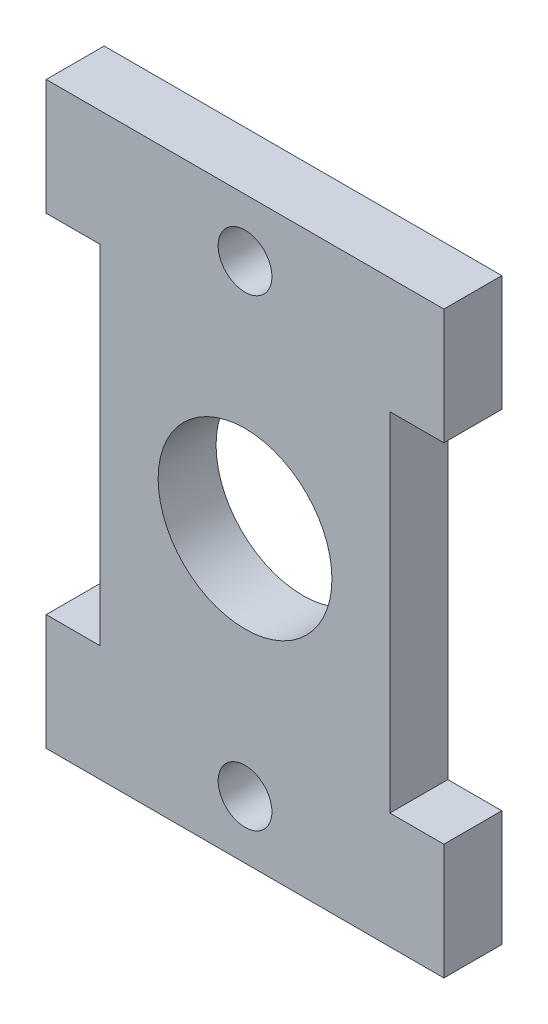
ISO-10303-21;
HEADER;
FILE_DESCRIPTION(('STEP AP214'),'2;1');
FILE_NAME('part.step','',(''),(''),'','','');
FILE_SCHEMA(('AUTOMOTIVE_DESIGN { 1 0 10303 214 1 1 1 1 }'));
ENDSEC;
DATA;
#1=APPLICATION_CONTEXT('core data for automotive mechanical design processes');
#2=APPLICATION_PROTOCOL_DEFINITION('international standard','automotive_design',2000,#1);
#3=PRODUCT_CONTEXT('',#1,'mechanical');
#4=PRODUCT('Part','Part','',(#3));
#5=PRODUCT_RELATED_PRODUCT_CATEGORY('part','',(#4));
#6=PRODUCT_DEFINITION_FORMATION('','',#4);
#7=PRODUCT_DEFINITION_CONTEXT('part definition',#1,'design');
#8=PRODUCT_DEFINITION('design','',#6,#7);
#9=PRODUCT_DEFINITION_SHAPE('','',#8);
#10=(LENGTH_UNIT() NAMED_UNIT(*) SI_UNIT(.MILLI.,.METRE.));
#11=(NAMED_UNIT(*) PLANE_ANGLE_UNIT() SI_UNIT($,.RADIAN.));
#12=(NAMED_UNIT(*) SI_UNIT($,.STERADIAN.) SOLID_ANGLE_UNIT());
#13=UNCERTAINTY_MEASURE_WITH_UNIT(LENGTH_MEASURE(1.E-05),#10,'distance_accuracy_value','');
#14=(GEOMETRIC_REPRESENTATION_CONTEXT(3) GLOBAL_UNCERTAINTY_ASSIGNED_CONTEXT((#13)) GLOBAL_UNIT_ASSIGNED_CONTEXT((#10,
#11,#12)) REPRESENTATION_CONTEXT('',''));
#15=CARTESIAN_POINT('',(0.,0.,0.));
#16=DIRECTION('',(0.,0.,1.));
#17=DIRECTION('',(1.,0.,0.));
#18=AXIS2_PLACEMENT_3D('',#15,#16,#17);
#19=CARTESIAN_POINT('',(10.8966,3.175,3.175));
#20=DIRECTION('',(-1.,0.,0.));
#21=DIRECTION('',(0.,0.,1.));
#22=AXIS2_PLACEMENT_3D('',#19,#20,#21);
#23=PLANE('',#22);
#24=DIRECTION('',(0.,1.,0.));
#25=VECTOR('',#24,1.);
#26=CARTESIAN_POINT('',(10.8966,3.175,0.));
#27=LINE('',#26,#25);
#28=CARTESIAN_POINT('',(10.8966,-3.175,0.));
#29=VERTEX_POINT('',#28);
#30=CARTESIAN_POINT('',(10.8966,3.175,0.));
#31=VERTEX_POINT('',#30);
#32=EDGE_CURVE('E154',#29,#31,#27,.T.);
#33=ORIENTED_EDGE('',*,*,#32,.T.);
#34=DIRECTION('',(0.,0.,-1.));
#35=VECTOR('',#34,1.);
#36=CARTESIAN_POINT('',(10.8966,3.175,3.175));
#37=LINE('',#36,#35);
#38=CARTESIAN_POINT('',(10.8966,3.175,3.175));
#39=VERTEX_POINT('',#38);
#40=EDGE_CURVE('E11',#39,#31,#37,.T.);
#41=ORIENTED_EDGE('',*,*,#40,.F.);
#42=DIRECTION('',(0.,1.,0.));
#43=VECTOR('',#42,1.);
#44=CARTESIAN_POINT('',(10.8966,3.175,3.175));
#45=LINE('',#44,#43);
#46=CARTESIAN_POINT('',(10.8966,-3.175,3.175));
#47=VERTEX_POINT('',#46);
#48=EDGE_CURVE('E177',#47,#39,#45,.T.);
#49=ORIENTED_EDGE('',*,*,#48,.F.);
#50=DIRECTION('',(0.,0.,-1.));
#51=VECTOR('',#50,1.);
#52=CARTESIAN_POINT('',(10.8966,-3.175,3.175));
#53=LINE('',#52,#51);
#54=EDGE_CURVE('E150',#47,#29,#53,.T.);
#55=ORIENTED_EDGE('',*,*,#54,.T.);
#56=EDGE_LOOP('',(#33,#41,#49,#55));
#57=FACE_BOUND('',#56,.T.);
#58=ADVANCED_FACE('F33',(#57),#23,.F.);
#59=CARTESIAN_POINT('',(-10.8966,3.175,3.175));
#60=DIRECTION('',(0.,-1.,0.));
#61=DIRECTION('',(0.,0.,-1.));
#62=AXIS2_PLACEMENT_3D('',#59,#60,#61);
#63=PLANE('',#62);
#64=DIRECTION('',(-1.,0.,0.));
#65=VECTOR('',#64,1.);
#66=CARTESIAN_POINT('',(-10.8966,3.175,0.));
#67=LINE('',#66,#65);
#68=CARTESIAN_POINT('',(-10.8966,3.175,0.));
#69=VERTEX_POINT('',#68);
#70=EDGE_CURVE('E157',#31,#69,#67,.T.);
#71=ORIENTED_EDGE('',*,*,#70,.T.);
#72=DIRECTION('',(0.,0.,-1.));
#73=VECTOR('',#72,1.);
#74=CARTESIAN_POINT('',(-10.8966,3.175,3.175));
#75=LINE('',#74,#73);
#76=CARTESIAN_POINT('',(-10.8966,3.175,3.175));
#77=VERTEX_POINT('',#76);
#78=EDGE_CURVE('E42',#77,#69,#75,.T.);
#79=ORIENTED_EDGE('',*,*,#78,.F.);
#80=DIRECTION('',(-1.,0.,0.));
#81=VECTOR('',#80,1.);
#82=CARTESIAN_POINT('',(-10.8966,3.175,3.175));
#83=LINE('',#82,#81);
#84=EDGE_CURVE('E105',#39,#77,#83,.T.);
#85=ORIENTED_EDGE('',*,*,#84,.F.);
#86=ORIENTED_EDGE('',*,*,#40,.T.);
#87=EDGE_LOOP('',(#71,#79,#85,#86));
#88=FACE_BOUND('',#87,.T.);
#89=ADVANCED_FACE('F258',(#88),#63,.F.);
#90=CARTESIAN_POINT('',(-10.8966,3.175,3.175));
#91=DIRECTION('',(1.,0.,0.));
#92=DIRECTION('',(0.,0.,-1.));
#93=AXIS2_PLACEMENT_3D('',#90,#91,#92);
#94=PLANE('',#93);
#95=DIRECTION('',(0.,-1.,0.));
#96=VECTOR('',#95,1.);
#97=CARTESIAN_POINT('',(-10.8966,3.175,0.));
#98=LINE('',#97,#96);
#99=CARTESIAN_POINT('',(-10.8966,-3.175,0.));
#100=VERTEX_POINT('',#99);
#101=EDGE_CURVE('E160',#69,#100,#98,.T.);
#102=ORIENTED_EDGE('',*,*,#101,.T.);
#103=DIRECTION('',(0.,0.,-1.));
#104=VECTOR('',#103,1.);
#105=CARTESIAN_POINT('',(-10.8966,-3.175,3.175));
#106=LINE('',#105,#104);
#107=CARTESIAN_POINT('',(-10.8966,-3.175,3.175));
#108=VERTEX_POINT('',#107);
#109=EDGE_CURVE('E196',#108,#100,#106,.T.);
#110=ORIENTED_EDGE('',*,*,#109,.F.);
#111=DIRECTION('',(0.,-1.,0.));
#112=VECTOR('',#111,1.);
#113=CARTESIAN_POINT('',(-10.8966,3.175,3.175));
#114=LINE('',#113,#112);
#115=EDGE_CURVE('E205',#77,#108,#114,.T.);
#116=ORIENTED_EDGE('',*,*,#115,.F.);
#117=ORIENTED_EDGE('',*,*,#78,.T.);
#118=EDGE_LOOP('',(#102,#110,#116,#117));
#119=FACE_BOUND('',#118,.T.);
#120=ADVANCED_FACE('F203',(#119),#94,.F.);
#121=CARTESIAN_POINT('',(-10.8966,-3.175,3.175));
#122=DIRECTION('',(0.,1.,0.));
#123=DIRECTION('',(0.,0.,1.));
#124=AXIS2_PLACEMENT_3D('',#121,#122,#123);
#125=PLANE('',#124);
#126=DIRECTION('',(1.,0.,0.));
#127=VECTOR('',#126,1.);
#128=CARTESIAN_POINT('',(-10.8966,-3.175,0.));
#129=LINE('',#128,#127);
#130=CARTESIAN_POINT('',(-7.9375,-3.175,0.));
#131=VERTEX_POINT('',#130);
#132=EDGE_CURVE('E162',#100,#131,#129,.T.);
#133=ORIENTED_EDGE('',*,*,#132,.T.);
#134=DIRECTION('',(0.,0.,-1.));
#135=VECTOR('',#134,1.);
#136=CARTESIAN_POINT('',(-7.9375,-3.175,3.175));
#137=LINE('',#136,#135);
#138=CARTESIAN_POINT('',(-7.9375,-3.175,3.175));
#139=VERTEX_POINT('',#138);
#140=EDGE_CURVE('E193',#139,#131,#137,.T.);
#141=ORIENTED_EDGE('',*,*,#140,.F.);
#142=DIRECTION('',(1.,0.,0.));
#143=VECTOR('',#142,1.);
#144=CARTESIAN_POINT('',(-10.8966,-3.175,3.175));
#145=LINE('',#144,#143);
#146=EDGE_CURVE('E223',#108,#139,#145,.T.);
#147=ORIENTED_EDGE('',*,*,#146,.F.);
#148=ORIENTED_EDGE('',*,*,#109,.T.);
#149=EDGE_LOOP('',(#133,#141,#147,#148));
#150=FACE_BOUND('',#149,.T.);
#151=ADVANCED_FACE('F214',(#150),#125,.F.);
#152=CARTESIAN_POINT('',(-7.9375,-3.175,3.175));
#153=DIRECTION('',(1.,0.,0.));
#154=DIRECTION('',(0.,0.,-1.));
#155=AXIS2_PLACEMENT_3D('',#152,#153,#154);
#156=PLANE('',#155);
#157=DIRECTION('',(0.,-1.,0.));
#158=VECTOR('',#157,1.);
#159=CARTESIAN_POINT('',(-7.9375,-3.175,0.));
#160=LINE('',#159,#158);
#161=CARTESIAN_POINT('',(-7.9375,-22.225,0.));
#162=VERTEX_POINT('',#161);
#163=EDGE_CURVE('E164',#131,#162,#160,.T.);
#164=ORIENTED_EDGE('',*,*,#163,.T.);
#165=DIRECTION('',(0.,0.,-1.));
#166=VECTOR('',#165,1.);
#167=CARTESIAN_POINT('',(-7.9375,-22.225,3.175));
#168=LINE('',#167,#166);
#169=CARTESIAN_POINT('',(-7.9375,-22.225,3.175));
#170=VERTEX_POINT('',#169);
#171=EDGE_CURVE('E190',#170,#162,#168,.T.);
#172=ORIENTED_EDGE('',*,*,#171,.F.);
#173=DIRECTION('',(0.,-1.,0.));
#174=VECTOR('',#173,1.);
#175=CARTESIAN_POINT('',(-7.9375,-3.175,3.175));
#176=LINE('',#175,#174);
#177=EDGE_CURVE('E220',#139,#170,#176,.T.);
#178=ORIENTED_EDGE('',*,*,#177,.F.);
#179=ORIENTED_EDGE('',*,*,#140,.T.);
#180=EDGE_LOOP('',(#164,#172,#178,#179));
#181=FACE_BOUND('',#180,.T.);
#182=ADVANCED_FACE('F218',(#181),#156,.F.);
#183=CARTESIAN_POINT('',(-10.8966,-22.225,3.175));
#184=DIRECTION('',(0.,-1.,0.));
#185=DIRECTION('',(1.,0.,0.));
#186=AXIS2_PLACEMENT_3D('',#183,#184,#185);
#187=PLANE('',#186);
#188=DIRECTION('',(-1.,0.,0.));
#189=VECTOR('',#188,1.);
#190=CARTESIAN_POINT('',(-10.8966,-22.225,0.));
#191=LINE('',#190,#189);
#192=CARTESIAN_POINT('',(-10.8966,-22.225,0.));
#193=VERTEX_POINT('',#192);
#194=EDGE_CURVE('E166',#162,#193,#191,.T.);
#195=ORIENTED_EDGE('',*,*,#194,.T.);
#196=DIRECTION('',(0.,0.,-1.));
#197=VECTOR('',#196,1.);
#198=CARTESIAN_POINT('',(-10.8966,-22.225,3.175));
#199=LINE('',#198,#197);
#200=CARTESIAN_POINT('',(-10.8966,-22.225,3.175));
#201=VERTEX_POINT('',#200);
#202=EDGE_CURVE('E187',#201,#193,#199,.T.);
#203=ORIENTED_EDGE('',*,*,#202,.F.);
#204=DIRECTION('',(-1.,0.,0.));
#205=VECTOR('',#204,1.);
#206=CARTESIAN_POINT('',(-10.8966,-22.225,3.175));
#207=LINE('',#206,#205);
#208=EDGE_CURVE('E222',#170,#201,#207,.T.);
#209=ORIENTED_EDGE('',*,*,#208,.F.);
#210=ORIENTED_EDGE('',*,*,#171,.T.);
#211=EDGE_LOOP('',(#195,#203,#209,#210));
#212=FACE_BOUND('',#211,.T.);
#213=ADVANCED_FACE('F271',(#212),#187,.F.);
#214=CARTESIAN_POINT('',(-10.8966,-28.575,3.175));
#215=DIRECTION('',(1.,0.,0.));
#216=DIRECTION('',(0.,0.,-1.));
#217=AXIS2_PLACEMENT_3D('',#214,#215,#216);
#218=PLANE('',#217);
#219=DIRECTION('',(0.,-1.,0.));
#220=VECTOR('',#219,1.);
#221=CARTESIAN_POINT('',(-10.8966,-28.575,0.));
#222=LINE('',#221,#220);
#223=CARTESIAN_POINT('',(-10.8966,-28.575,0.));
#224=VERTEX_POINT('',#223);
#225=EDGE_CURVE('E168',#193,#224,#222,.T.);
#226=ORIENTED_EDGE('',*,*,#225,.T.);
#227=DIRECTION('',(0.,0.,-1.));
#228=VECTOR('',#227,1.);
#229=CARTESIAN_POINT('',(-10.8966,-28.575,3.175));
#230=LINE('',#229,#228);
#231=CARTESIAN_POINT('',(-10.8966,-28.575,3.175));
#232=VERTEX_POINT('',#231);
#233=EDGE_CURVE('E184',#232,#224,#230,.T.);
#234=ORIENTED_EDGE('',*,*,#233,.F.);
#235=DIRECTION('',(0.,-1.,0.));
#236=VECTOR('',#235,1.);
#237=CARTESIAN_POINT('',(-10.8966,-28.575,3.175));
#238=LINE('',#237,#236);
#239=EDGE_CURVE('E225',#201,#232,#238,.T.);
#240=ORIENTED_EDGE('',*,*,#239,.F.);
#241=ORIENTED_EDGE('',*,*,#202,.T.);
#242=EDGE_LOOP('',(#226,#234,#240,#241));
#243=FACE_BOUND('',#242,.T.);
#244=ADVANCED_FACE('F274',(#243),#218,.F.);
#245=CARTESIAN_POINT('',(-10.8966,-28.575,3.175));
#246=DIRECTION('',(0.,1.,0.));
#247=DIRECTION('',(0.,0.,1.));
#248=AXIS2_PLACEMENT_3D('',#245,#246,#247);
#249=PLANE('',#248);
#250=DIRECTION('',(1.,0.,0.));
#251=VECTOR('',#250,1.);
#252=CARTESIAN_POINT('',(-10.8966,-28.575,0.));
#253=LINE('',#252,#251);
#254=CARTESIAN_POINT('',(10.8966,-28.575,0.));
#255=VERTEX_POINT('',#254);
#256=EDGE_CURVE('E170',#224,#255,#253,.T.);
#257=ORIENTED_EDGE('',*,*,#256,.T.);
#258=DIRECTION('',(0.,0.,-1.));
#259=VECTOR('',#258,1.);
#260=CARTESIAN_POINT('',(10.8966,-28.575,3.175));
#261=LINE('',#260,#259);
#262=CARTESIAN_POINT('',(10.8966,-28.575,3.175));
#263=VERTEX_POINT('',#262);
#264=EDGE_CURVE('E181',#263,#255,#261,.T.);
#265=ORIENTED_EDGE('',*,*,#264,.F.);
#266=DIRECTION('',(1.,0.,0.));
#267=VECTOR('',#266,1.);
#268=CARTESIAN_POINT('',(-10.8966,-28.575,3.175));
#269=LINE('',#268,#267);
#270=EDGE_CURVE('E231',#232,#263,#269,.T.);
#271=ORIENTED_EDGE('',*,*,#270,.F.);
#272=ORIENTED_EDGE('',*,*,#233,.T.);
#273=EDGE_LOOP('',(#257,#265,#271,#272));
#274=FACE_BOUND('',#273,.T.);
#275=ADVANCED_FACE('F237',(#274),#249,.F.);
#276=CARTESIAN_POINT('',(10.8966,-28.575,3.175));
#277=DIRECTION('',(-1.,0.,0.));
#278=DIRECTION('',(0.,0.,1.));
#279=AXIS2_PLACEMENT_3D('',#276,#277,#278);
#280=PLANE('',#279);
#281=DIRECTION('',(0.,1.,0.));
#282=VECTOR('',#281,1.);
#283=CARTESIAN_POINT('',(10.8966,-28.575,0.));
#284=LINE('',#283,#282);
#285=CARTESIAN_POINT('',(10.8966,-22.225,0.));
#286=VERTEX_POINT('',#285);
#287=EDGE_CURVE('E172',#255,#286,#284,.T.);
#288=ORIENTED_EDGE('',*,*,#287,.T.);
#289=DIRECTION('',(0.,0.,-1.));
#290=VECTOR('',#289,1.);
#291=CARTESIAN_POINT('',(10.8966,-22.225,3.175));
#292=LINE('',#291,#290);
#293=CARTESIAN_POINT('',(10.8966,-22.225,3.175));
#294=VERTEX_POINT('',#293);
#295=EDGE_CURVE('E145',#294,#286,#292,.T.);
#296=ORIENTED_EDGE('',*,*,#295,.F.);
#297=DIRECTION('',(0.,1.,0.));
#298=VECTOR('',#297,1.);
#299=CARTESIAN_POINT('',(10.8966,-28.575,3.175));
#300=LINE('',#299,#298);
#301=EDGE_CURVE('E136',#263,#294,#300,.T.);
#302=ORIENTED_EDGE('',*,*,#301,.F.);
#303=ORIENTED_EDGE('',*,*,#264,.T.);
#304=EDGE_LOOP('',(#288,#296,#302,#303));
#305=FACE_BOUND('',#304,.T.);
#306=ADVANCED_FACE('F241',(#305),#280,.F.);
#307=CARTESIAN_POINT('',(7.9375,-22.225,3.175));
#308=DIRECTION('',(0.,-1.,0.));
#309=DIRECTION('',(1.,0.,0.));
#310=AXIS2_PLACEMENT_3D('',#307,#308,#309);
#311=PLANE('',#310);
#312=DIRECTION('',(-1.,0.,0.));
#313=VECTOR('',#312,1.);
#314=CARTESIAN_POINT('',(7.9375,-22.225,0.));
#315=LINE('',#314,#313);
#316=CARTESIAN_POINT('',(7.9375,-22.225,0.));
#317=VERTEX_POINT('',#316);
#318=EDGE_CURVE('E144',#286,#317,#315,.T.);
#319=ORIENTED_EDGE('',*,*,#318,.T.);
#320=DIRECTION('',(0.,0.,-1.));
#321=VECTOR('',#320,1.);
#322=CARTESIAN_POINT('',(7.9375,-22.225,3.175));
#323=LINE('',#322,#321);
#324=CARTESIAN_POINT('',(7.9375,-22.225,3.175));
#325=VERTEX_POINT('',#324);
#326=EDGE_CURVE('E141',#325,#317,#323,.T.);
#327=ORIENTED_EDGE('',*,*,#326,.F.);
#328=DIRECTION('',(-1.,0.,0.));
#329=VECTOR('',#328,1.);
#330=CARTESIAN_POINT('',(7.9375,-22.225,3.175));
#331=LINE('',#330,#329);
#332=EDGE_CURVE('E130',#294,#325,#331,.T.);
#333=ORIENTED_EDGE('',*,*,#332,.F.);
#334=ORIENTED_EDGE('',*,*,#295,.T.);
#335=EDGE_LOOP('',(#319,#327,#333,#334));
#336=FACE_BOUND('',#335,.T.);
#337=ADVANCED_FACE('F142',(#336),#311,.F.);
#338=CARTESIAN_POINT('',(7.9375,-3.175,3.175));
#339=DIRECTION('',(-1.,0.,0.));
#340=DIRECTION('',(0.,0.,1.));
#341=AXIS2_PLACEMENT_3D('',#338,#339,#340);
#342=PLANE('',#341);
#343=DIRECTION('',(0.,1.,0.));
#344=VECTOR('',#343,1.);
#345=CARTESIAN_POINT('',(7.9375,-3.175,0.));
#346=LINE('',#345,#344);
#347=CARTESIAN_POINT('',(7.9375,-3.175,0.));
#348=VERTEX_POINT('',#347);
#349=EDGE_CURVE('E91',#317,#348,#346,.T.);
#350=ORIENTED_EDGE('',*,*,#349,.T.);
#351=DIRECTION('',(0.,0.,-1.));
#352=VECTOR('',#351,1.);
#353=CARTESIAN_POINT('',(7.9375,-3.175,3.175));
#354=LINE('',#353,#352);
#355=CARTESIAN_POINT('',(7.9375,-3.175,3.175));
#356=VERTEX_POINT('',#355);
#357=EDGE_CURVE('E146',#356,#348,#354,.T.);
#358=ORIENTED_EDGE('',*,*,#357,.F.);
#359=DIRECTION('',(0.,1.,0.));
#360=VECTOR('',#359,1.);
#361=CARTESIAN_POINT('',(7.9375,-3.175,3.175));
#362=LINE('',#361,#360);
#363=EDGE_CURVE('E134',#325,#356,#362,.T.);
#364=ORIENTED_EDGE('',*,*,#363,.F.);
#365=ORIENTED_EDGE('',*,*,#326,.T.);
#366=EDGE_LOOP('',(#350,#358,#364,#365));
#367=FACE_BOUND('',#366,.T.);
#368=ADVANCED_FACE('F148',(#367),#342,.F.);
#369=CARTESIAN_POINT('',(7.9375,-3.175,3.175));
#370=DIRECTION('',(0.,1.,0.));
#371=DIRECTION('',(0.,0.,1.));
#372=AXIS2_PLACEMENT_3D('',#369,#370,#371);
#373=PLANE('',#372);
#374=DIRECTION('',(1.,0.,0.));
#375=VECTOR('',#374,1.);
#376=CARTESIAN_POINT('',(7.9375,-3.175,0.));
#377=LINE('',#376,#375);
#378=EDGE_CURVE('E97',#348,#29,#377,.T.);
#379=ORIENTED_EDGE('',*,*,#378,.T.);
#380=ORIENTED_EDGE('',*,*,#54,.F.);
#381=DIRECTION('',(1.,0.,0.));
#382=VECTOR('',#381,1.);
#383=CARTESIAN_POINT('',(7.9375,-3.175,3.175));
#384=LINE('',#383,#382);
#385=EDGE_CURVE('E50',#356,#47,#384,.T.);
#386=ORIENTED_EDGE('',*,*,#385,.F.);
#387=ORIENTED_EDGE('',*,*,#357,.T.);
#388=EDGE_LOOP('',(#379,#380,#386,#387));
#389=FACE_BOUND('',#388,.T.);
#390=ADVANCED_FACE('F245',(#389),#373,.F.);
#391=CARTESIAN_POINT('',(0.,0.,3.175));
#392=DIRECTION('',(0.,0.,1.));
#393=DIRECTION('',(1.,0.,0.));
#394=AXIS2_PLACEMENT_3D('',#391,#392,#393);
#395=PLANE('',#394);
#396=CARTESIAN_POINT('',(0.,-12.7,3.175));
#397=DIRECTION('',(0.,0.,1.));
#398=DIRECTION('',(1.,0.,0.));
#399=AXIS2_PLACEMENT_3D('',#396,#397,#398);
#400=CIRCLE('',#399,4.7625);
#401=CARTESIAN_POINT('',(4.7625,-12.7,3.175));
#402=VERTEX_POINT('',#401);
#403=EDGE_CURVE('E342',#402,#402,#400,.T.);
#404=ORIENTED_EDGE('',*,*,#403,.F.);
#405=EDGE_LOOP('',(#404));
#406=FACE_BOUND('',#405,.T.);
#407=CARTESIAN_POINT('',(0.,0.,3.175));
#408=DIRECTION('',(0.,0.,1.));
#409=DIRECTION('',(1.,0.,0.));
#410=AXIS2_PLACEMENT_3D('',#407,#408,#409);
#411=CIRCLE('',#410,1.47319999999999);
#412=CARTESIAN_POINT('',(1.47319999999999,0.,3.175));
#413=VERTEX_POINT('',#412);
#414=EDGE_CURVE('E346',#413,#413,#411,.T.);
#415=ORIENTED_EDGE('',*,*,#414,.F.);
#416=EDGE_LOOP('',(#415));
#417=FACE_BOUND('',#416,.T.);
#418=CARTESIAN_POINT('',(0.,-25.4,3.175));
#419=DIRECTION('',(0.,0.,1.));
#420=DIRECTION('',(1.,0.,0.));
#421=AXIS2_PLACEMENT_3D('',#418,#419,#420);
#422=CIRCLE('',#421,1.47319999999999);
#423=CARTESIAN_POINT('',(1.47319999999999,-25.4,3.175));
#424=VERTEX_POINT('',#423);
#425=EDGE_CURVE('E352',#424,#424,#422,.T.);
#426=ORIENTED_EDGE('',*,*,#425,.F.);
#427=EDGE_LOOP('',(#426));
#428=FACE_BOUND('',#427,.T.);
#429=ORIENTED_EDGE('',*,*,#48,.T.);
#430=ORIENTED_EDGE('',*,*,#84,.T.);
#431=ORIENTED_EDGE('',*,*,#115,.T.);
#432=ORIENTED_EDGE('',*,*,#146,.T.);
#433=ORIENTED_EDGE('',*,*,#177,.T.);
#434=ORIENTED_EDGE('',*,*,#208,.T.);
#435=ORIENTED_EDGE('',*,*,#239,.T.);
#436=ORIENTED_EDGE('',*,*,#270,.T.);
#437=ORIENTED_EDGE('',*,*,#301,.T.);
#438=ORIENTED_EDGE('',*,*,#332,.T.);
#439=ORIENTED_EDGE('',*,*,#363,.T.);
#440=ORIENTED_EDGE('',*,*,#385,.T.);
#441=EDGE_LOOP('',(#429,#430,#431,#432,#433,#434,#435,#436,#437,#438,#439,#440));
#442=FACE_BOUND('',#441,.T.);
#443=ADVANCED_FACE('F132',(#406,#417,#428,#442),#395,.T.);
#444=CARTESIAN_POINT('',(0.,0.,0.));
#445=DIRECTION('',(0.,0.,1.));
#446=DIRECTION('',(1.,0.,0.));
#447=AXIS2_PLACEMENT_3D('',#444,#445,#446);
#448=PLANE('',#447);
#449=CARTESIAN_POINT('',(0.,-12.7,0.));
#450=DIRECTION('',(0.,0.,1.));
#451=DIRECTION('',(1.,0.,0.));
#452=AXIS2_PLACEMENT_3D('',#449,#450,#451);
#453=CIRCLE('',#452,4.7625);
#454=CARTESIAN_POINT('',(4.7625,-12.7,0.));
#455=VERTEX_POINT('',#454);
#456=EDGE_CURVE('E345',#455,#455,#453,.F.);
#457=ORIENTED_EDGE('',*,*,#456,.F.);
#458=EDGE_LOOP('',(#457));
#459=FACE_BOUND('',#458,.T.);
#460=CARTESIAN_POINT('',(0.,0.,0.));
#461=DIRECTION('',(0.,0.,1.));
#462=DIRECTION('',(1.,0.,0.));
#463=AXIS2_PLACEMENT_3D('',#460,#461,#462);
#464=CIRCLE('',#463,1.47319999999999);
#465=CARTESIAN_POINT('',(1.47319999999999,0.,0.));
#466=VERTEX_POINT('',#465);
#467=EDGE_CURVE('E36',#466,#466,#464,.T.);
#468=ORIENTED_EDGE('',*,*,#467,.T.);
#469=EDGE_LOOP('',(#468));
#470=FACE_BOUND('',#469,.T.);
#471=CARTESIAN_POINT('',(0.,-25.4,0.));
#472=DIRECTION('',(0.,0.,1.));
#473=DIRECTION('',(1.,0.,0.));
#474=AXIS2_PLACEMENT_3D('',#471,#472,#473);
#475=CIRCLE('',#474,1.47319999999999);
#476=CARTESIAN_POINT('',(1.47319999999999,-25.4,0.));
#477=VERTEX_POINT('',#476);
#478=EDGE_CURVE('E158',#477,#477,#475,.T.);
#479=ORIENTED_EDGE('',*,*,#478,.T.);
#480=EDGE_LOOP('',(#479));
#481=FACE_BOUND('',#480,.T.);
#482=ORIENTED_EDGE('',*,*,#32,.F.);
#483=ORIENTED_EDGE('',*,*,#378,.F.);
#484=ORIENTED_EDGE('',*,*,#349,.F.);
#485=ORIENTED_EDGE('',*,*,#318,.F.);
#486=ORIENTED_EDGE('',*,*,#287,.F.);
#487=ORIENTED_EDGE('',*,*,#256,.F.);
#488=ORIENTED_EDGE('',*,*,#225,.F.);
#489=ORIENTED_EDGE('',*,*,#194,.F.);
#490=ORIENTED_EDGE('',*,*,#163,.F.);
#491=ORIENTED_EDGE('',*,*,#132,.F.);
#492=ORIENTED_EDGE('',*,*,#101,.F.);
#493=ORIENTED_EDGE('',*,*,#70,.F.);
#494=EDGE_LOOP('',(#482,#483,#484,#485,#486,#487,#488,#489,#490,#491,#492,#493));
#495=FACE_BOUND('',#494,.T.);
#496=ADVANCED_FACE('F209',(#459,#470,#481,#495),#448,.F.);
#497=CARTESIAN_POINT('',(0.,-25.4,3.175));
#498=DIRECTION('',(0.,0.,1.));
#499=DIRECTION('',(1.,0.,0.));
#500=AXIS2_PLACEMENT_3D('',#497,#498,#499);
#501=CYLINDRICAL_SURFACE('',#500,1.47319999999999);
#502=ORIENTED_EDGE('',*,*,#425,.T.);
#503=EDGE_LOOP('',(#502));
#504=FACE_BOUND('',#503,.T.);
#505=ORIENTED_EDGE('',*,*,#478,.F.);
#506=EDGE_LOOP('',(#505));
#507=FACE_BOUND('',#506,.T.);
#508=ADVANCED_FACE('F302',(#504,#507),#501,.F.);
#509=CARTESIAN_POINT('',(0.,0.,3.175));
#510=DIRECTION('',(0.,0.,1.));
#511=DIRECTION('',(1.,0.,0.));
#512=AXIS2_PLACEMENT_3D('',#509,#510,#511);
#513=CYLINDRICAL_SURFACE('',#512,1.47319999999999);
#514=ORIENTED_EDGE('',*,*,#414,.T.);
#515=EDGE_LOOP('',(#514));
#516=FACE_BOUND('',#515,.T.);
#517=ORIENTED_EDGE('',*,*,#467,.F.);
#518=EDGE_LOOP('',(#517));
#519=FACE_BOUND('',#518,.T.);
#520=ADVANCED_FACE('F307',(#516,#519),#513,.F.);
#521=CARTESIAN_POINT('',(0.,-12.7,-0.00100000000000013));
#522=DIRECTION('',(0.,0.,1.));
#523=DIRECTION('',(1.,0.,0.));
#524=AXIS2_PLACEMENT_3D('',#521,#522,#523);
#525=CYLINDRICAL_SURFACE('',#524,4.7625);
#526=ORIENTED_EDGE('',*,*,#403,.T.);
#527=EDGE_LOOP('',(#526));
#528=FACE_BOUND('',#527,.T.);
#529=ORIENTED_EDGE('',*,*,#456,.T.);
#530=EDGE_LOOP('',(#529));
#531=FACE_BOUND('',#530,.T.);
#532=ADVANCED_FACE('F318',(#528,#531),#525,.F.);
#533=CLOSED_SHELL('',(#58,#89,#120,#151,#182,#213,#244,#275,#306,#337,#368,#390,#443,#496,#508,
#520,#532));
#534=MANIFOLD_SOLID_BREP('B2',#533);
#535=ADVANCED_BREP_SHAPE_REPRESENTATION('',(#18,#534),#14);
#536=SHAPE_DEFINITION_REPRESENTATION(#9,#535);
ENDSEC;
END-ISO-10303-21;
